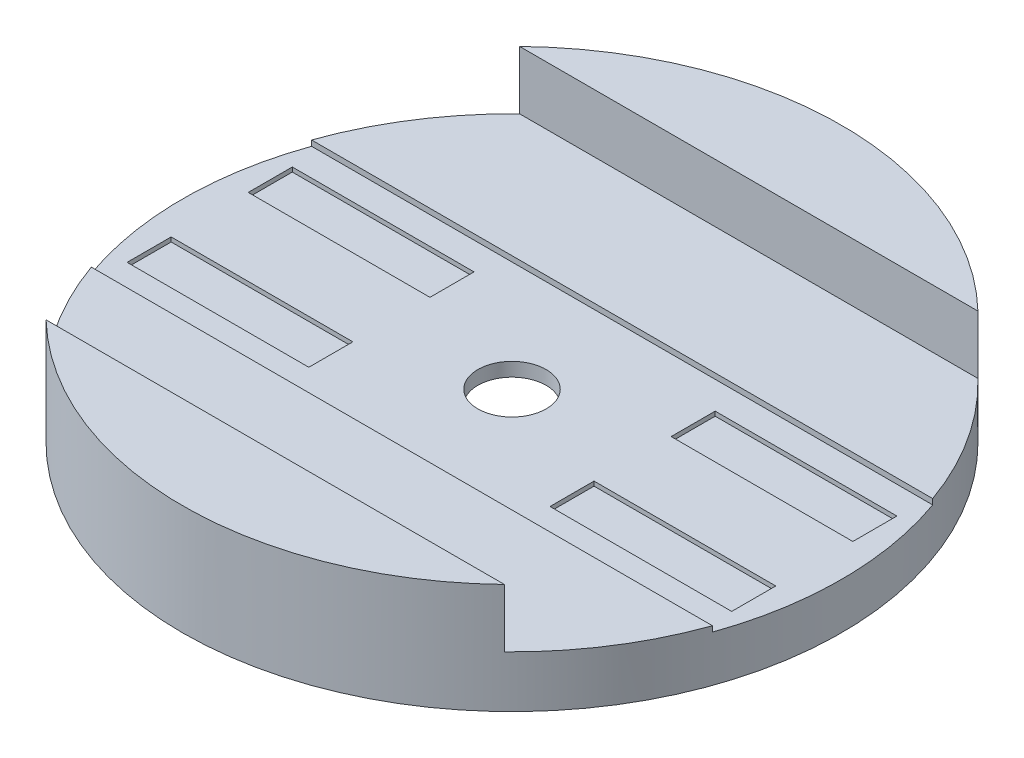
ISO-10303-21;
HEADER;
FILE_DESCRIPTION(('STEP AP214'),'2;1');
FILE_NAME('part.step','',(''),(''),'','','');
FILE_SCHEMA(('AUTOMOTIVE_DESIGN { 1 0 10303 214 1 1 1 1 }'));
ENDSEC;
DATA;
#1=APPLICATION_CONTEXT('core data for automotive mechanical design processes');
#2=APPLICATION_PROTOCOL_DEFINITION('international standard','automotive_design',2000,#1);
#3=PRODUCT_CONTEXT('',#1,'mechanical');
#4=PRODUCT('Part','Part','',(#3));
#5=PRODUCT_RELATED_PRODUCT_CATEGORY('part','',(#4));
#6=PRODUCT_DEFINITION_FORMATION('','',#4);
#7=PRODUCT_DEFINITION_CONTEXT('part definition',#1,'design');
#8=PRODUCT_DEFINITION('design','',#6,#7);
#9=PRODUCT_DEFINITION_SHAPE('','',#8);
#10=(LENGTH_UNIT() NAMED_UNIT(*) SI_UNIT(.MILLI.,.METRE.));
#11=(NAMED_UNIT(*) PLANE_ANGLE_UNIT() SI_UNIT($,.RADIAN.));
#12=(NAMED_UNIT(*) SI_UNIT($,.STERADIAN.) SOLID_ANGLE_UNIT());
#13=UNCERTAINTY_MEASURE_WITH_UNIT(LENGTH_MEASURE(1.E-05),#10,'distance_accuracy_value','');
#14=(GEOMETRIC_REPRESENTATION_CONTEXT(3) GLOBAL_UNCERTAINTY_ASSIGNED_CONTEXT((#13)) GLOBAL_UNIT_ASSIGNED_CONTEXT((#10,
#11,#12)) REPRESENTATION_CONTEXT('',''));
#15=CARTESIAN_POINT('',(0.,0.,0.));
#16=DIRECTION('',(0.,0.,1.));
#17=DIRECTION('',(1.,0.,0.));
#18=AXIS2_PLACEMENT_3D('',#15,#16,#17);
#19=CARTESIAN_POINT('',(0.,-8.062,0.));
#20=DIRECTION('',(0.,1.,0.));
#21=DIRECTION('',(0.,0.,1.));
#22=AXIS2_PLACEMENT_3D('',#19,#20,#21);
#23=CYLINDRICAL_SURFACE('',#22,7.874);
#24=CARTESIAN_POINT('',(0.,7.5,0.));
#25=DIRECTION('',(0.,-1.,0.));
#26=DIRECTION('',(0.,0.,-1.));
#27=AXIS2_PLACEMENT_3D('',#24,#25,#26);
#28=CIRCLE('',#27,7.874);
#29=CARTESIAN_POINT('',(0.,7.5,-7.874));
#30=VERTEX_POINT('',#29);
#31=EDGE_CURVE('E376',#30,#30,#28,.F.);
#32=ORIENTED_EDGE('',*,*,#31,.F.);
#33=EDGE_LOOP('',(#32));
#34=FACE_BOUND('',#33,.T.);
#35=CARTESIAN_POINT('',(0.,10.668,0.));
#36=DIRECTION('',(0.,1.,0.));
#37=DIRECTION('',(0.,0.,1.));
#38=AXIS2_PLACEMENT_3D('',#35,#36,#37);
#39=CIRCLE('',#38,7.874);
#40=CARTESIAN_POINT('',(0.,10.668,7.874));
#41=VERTEX_POINT('',#40);
#42=EDGE_CURVE('E369',#41,#41,#39,.F.);
#43=ORIENTED_EDGE('',*,*,#42,.F.);
#44=EDGE_LOOP('',(#43));
#45=FACE_BOUND('',#44,.T.);
#46=ADVANCED_FACE('F60',(#34,#45),#23,.F.);
#47=CARTESIAN_POINT('',(-58.0079555223723,11.938,0.));
#48=DIRECTION('',(0.,1.,0.));
#49=DIRECTION('',(0.,0.,1.));
#50=AXIS2_PLACEMENT_3D('',#47,#48,#49);
#51=PLANE('',#50);
#52=DIRECTION('',(1.,0.,0.));
#53=VECTOR('',#52,1.);
#54=CARTESIAN_POINT('',(-58.0079555223722,11.938,25.4));
#55=LINE('',#54,#53);
#56=CARTESIAN_POINT('',(-71.6298820325707,11.938,25.4));
#57=VERTEX_POINT('',#56);
#58=CARTESIAN_POINT('',(71.6298820325707,11.938,25.4));
#59=VERTEX_POINT('',#58);
#60=EDGE_CURVE('E417',#57,#59,#55,.T.);
#61=ORIENTED_EDGE('',*,*,#60,.F.);
#62=CARTESIAN_POINT('',(0.,11.938,0.));
#63=DIRECTION('',(0.,1.,0.));
#64=DIRECTION('',(0.,0.,1.));
#65=AXIS2_PLACEMENT_3D('',#62,#63,#64);
#66=CIRCLE('',#65,76.);
#67=CARTESIAN_POINT('',(-52.8559164143429,11.938,54.61));
#68=VERTEX_POINT('',#67);
#69=EDGE_CURVE('E408',#57,#68,#66,.T.);
#70=ORIENTED_EDGE('',*,*,#69,.T.);
#71=DIRECTION('',(1.,0.,0.));
#72=VECTOR('',#71,1.);
#73=CARTESIAN_POINT('',(-58.0079555223723,11.938,54.61));
#74=LINE('',#73,#72);
#75=CARTESIAN_POINT('',(52.8559164143429,11.938,54.61));
#76=VERTEX_POINT('',#75);
#77=EDGE_CURVE('E379',#68,#76,#74,.T.);
#78=ORIENTED_EDGE('',*,*,#77,.T.);
#79=EDGE_CURVE('E413',#76,#59,#66,.T.);
#80=ORIENTED_EDGE('',*,*,#79,.T.);
#81=EDGE_LOOP('',(#61,#70,#78,#80));
#82=FACE_BOUND('',#81,.T.);
#83=ADVANCED_FACE('F439',(#82),#51,.T.);
#84=CARTESIAN_POINT('',(0.,25.4,0.));
#85=DIRECTION('',(0.,1.,0.));
#86=DIRECTION('',(0.,0.,1.));
#87=AXIS2_PLACEMENT_3D('',#84,#85,#86);
#88=PLANE('',#87);
#89=DIRECTION('',(-1.,0.,0.));
#90=VECTOR('',#89,1.);
#91=CARTESIAN_POINT('',(0.,25.4,-54.61));
#92=LINE('',#91,#90);
#93=CARTESIAN_POINT('',(52.8559164143428,25.4,-54.61));
#94=VERTEX_POINT('',#93);
#95=CARTESIAN_POINT('',(-52.8559164143428,25.4,-54.61));
#96=VERTEX_POINT('',#95);
#97=EDGE_CURVE('E406',#94,#96,#92,.T.);
#98=ORIENTED_EDGE('',*,*,#97,.F.);
#99=CARTESIAN_POINT('',(0.,25.4,0.));
#100=DIRECTION('',(0.,1.,0.));
#101=DIRECTION('',(0.,0.,1.));
#102=AXIS2_PLACEMENT_3D('',#99,#100,#101);
#103=CIRCLE('',#102,76.);
#104=EDGE_CURVE('E401',#94,#96,#103,.T.);
#105=ORIENTED_EDGE('',*,*,#104,.T.);
#106=EDGE_LOOP('',(#98,#105));
#107=FACE_BOUND('',#106,.T.);
#108=ADVANCED_FACE('F450',(#107),#88,.T.);
#109=CARTESIAN_POINT('',(0.,25.4,0.));
#110=DIRECTION('',(0.,-1.,0.));
#111=DIRECTION('',(0.,0.,-1.));
#112=AXIS2_PLACEMENT_3D('',#109,#110,#111);
#113=CYLINDRICAL_SURFACE('',#112,76.);
#114=CARTESIAN_POINT('',(0.,10.668,0.));
#115=DIRECTION('',(0.,1.,0.));
#116=DIRECTION('',(0.,0.,1.));
#117=AXIS2_PLACEMENT_3D('',#114,#115,#116);
#118=CIRCLE('',#117,76.);
#119=CARTESIAN_POINT('',(71.6298820325707,10.668,25.4));
#120=VERTEX_POINT('',#119);
#121=CARTESIAN_POINT('',(71.6298820325707,10.668,-25.4000000000001));
#122=VERTEX_POINT('',#121);
#123=EDGE_CURVE('E12',#120,#122,#118,.T.);
#124=ORIENTED_EDGE('',*,*,#123,.F.);
#125=DIRECTION('',(0.,-1.,0.));
#126=VECTOR('',#125,1.);
#127=CARTESIAN_POINT('',(71.6298820325707,25.4,25.4));
#128=LINE('',#127,#126);
#129=EDGE_CURVE('E363',#120,#59,#128,.F.);
#130=ORIENTED_EDGE('',*,*,#129,.T.);
#131=ORIENTED_EDGE('',*,*,#79,.F.);
#132=DIRECTION('',(0.,-1.,0.));
#133=VECTOR('',#132,1.);
#134=CARTESIAN_POINT('',(52.8559164143429,25.4,54.61));
#135=LINE('',#134,#133);
#136=CARTESIAN_POINT('',(52.8559164143428,25.4,54.61));
#137=VERTEX_POINT('',#136);
#138=EDGE_CURVE('E385',#76,#137,#135,.F.);
#139=ORIENTED_EDGE('',*,*,#138,.T.);
#140=CARTESIAN_POINT('',(-52.8559164143429,25.4,54.61));
#141=VERTEX_POINT('',#140);
#142=EDGE_CURVE('E398',#141,#137,#103,.T.);
#143=ORIENTED_EDGE('',*,*,#142,.F.);
#144=DIRECTION('',(0.,-1.,0.));
#145=VECTOR('',#144,1.);
#146=CARTESIAN_POINT('',(-52.8559164143429,25.4,54.61));
#147=LINE('',#146,#145);
#148=EDGE_CURVE('E388',#141,#68,#147,.T.);
#149=ORIENTED_EDGE('',*,*,#148,.T.);
#150=ORIENTED_EDGE('',*,*,#69,.F.);
#151=DIRECTION('',(0.,-1.,0.));
#152=VECTOR('',#151,1.);
#153=CARTESIAN_POINT('',(-71.6298820325707,25.4,25.4));
#154=LINE('',#153,#152);
#155=CARTESIAN_POINT('',(-71.6298820325707,10.668,25.4));
#156=VERTEX_POINT('',#155);
#157=EDGE_CURVE('E366',#57,#156,#154,.T.);
#158=ORIENTED_EDGE('',*,*,#157,.T.);
#159=CARTESIAN_POINT('',(-71.6298820325707,10.668,-25.4));
#160=VERTEX_POINT('',#159);
#161=EDGE_CURVE('E64',#160,#156,#118,.T.);
#162=ORIENTED_EDGE('',*,*,#161,.F.);
#163=DIRECTION('',(0.,-1.,0.));
#164=VECTOR('',#163,1.);
#165=CARTESIAN_POINT('',(-71.6298820325707,25.4,-25.4));
#166=LINE('',#165,#164);
#167=CARTESIAN_POINT('',(-71.6298820325708,11.938,-25.4));
#168=VERTEX_POINT('',#167);
#169=EDGE_CURVE('E357',#160,#168,#166,.F.);
#170=ORIENTED_EDGE('',*,*,#169,.T.);
#171=CARTESIAN_POINT('',(-52.8559164143428,11.938,-54.61));
#172=VERTEX_POINT('',#171);
#173=EDGE_CURVE('E409',#172,#168,#66,.T.);
#174=ORIENTED_EDGE('',*,*,#173,.F.);
#175=DIRECTION('',(0.,-1.,0.));
#176=VECTOR('',#175,1.);
#177=CARTESIAN_POINT('',(-52.8559164143428,25.4,-54.61));
#178=LINE('',#177,#176);
#179=EDGE_CURVE('E391',#172,#96,#178,.F.);
#180=ORIENTED_EDGE('',*,*,#179,.T.);
#181=ORIENTED_EDGE('',*,*,#104,.F.);
#182=DIRECTION('',(0.,-1.,0.));
#183=VECTOR('',#182,1.);
#184=CARTESIAN_POINT('',(52.8559164143428,25.4,-54.61));
#185=LINE('',#184,#183);
#186=CARTESIAN_POINT('',(52.8559164143428,11.938,-54.61));
#187=VERTEX_POINT('',#186);
#188=EDGE_CURVE('E394',#94,#187,#185,.T.);
#189=ORIENTED_EDGE('',*,*,#188,.T.);
#190=CARTESIAN_POINT('',(71.6298820325707,11.938,-25.4000000000001));
#191=VERTEX_POINT('',#190);
#192=EDGE_CURVE('E412',#191,#187,#66,.T.);
#193=ORIENTED_EDGE('',*,*,#192,.F.);
#194=DIRECTION('',(0.,-1.,0.));
#195=VECTOR('',#194,1.);
#196=CARTESIAN_POINT('',(71.6298820325707,25.4,-25.4000000000001));
#197=LINE('',#196,#195);
#198=EDGE_CURVE('E360',#191,#122,#197,.T.);
#199=ORIENTED_EDGE('',*,*,#198,.T.);
#200=EDGE_LOOP('',(#124,#130,#131,#139,#143,#149,#150,#158,#162,#170,#174,#180,#181,#189,#193,#199));
#201=FACE_BOUND('',#200,.T.);
#202=CARTESIAN_POINT('',(0.,0.,0.));
#203=DIRECTION('',(0.,1.,0.));
#204=DIRECTION('',(0.,0.,1.));
#205=AXIS2_PLACEMENT_3D('',#202,#203,#204);
#206=CIRCLE('',#205,76.);
#207=CARTESIAN_POINT('',(0.,0.,76.));
#208=VERTEX_POINT('',#207);
#209=EDGE_CURVE('E397',#208,#208,#206,.T.);
#210=ORIENTED_EDGE('',*,*,#209,.T.);
#211=EDGE_LOOP('',(#210));
#212=FACE_BOUND('',#211,.T.);
#213=ADVANCED_FACE('F62',(#201,#212),#113,.T.);
#214=DIRECTION('',(1.,0.,0.));
#215=VECTOR('',#214,1.);
#216=CARTESIAN_POINT('',(0.,25.4,54.61));
#217=LINE('',#216,#215);
#218=EDGE_CURVE('E404',#141,#137,#217,.T.);
#219=ORIENTED_EDGE('',*,*,#218,.F.);
#220=ORIENTED_EDGE('',*,*,#142,.T.);
#221=EDGE_LOOP('',(#219,#220));
#222=FACE_BOUND('',#221,.T.);
#223=ADVANCED_FACE('F453',(#222),#88,.T.);
#224=CARTESIAN_POINT('',(0.,0.,0.));
#225=DIRECTION('',(0.,1.,0.));
#226=DIRECTION('',(0.,0.,1.));
#227=AXIS2_PLACEMENT_3D('',#224,#225,#226);
#228=PLANE('',#227);
#229=CARTESIAN_POINT('',(0.,0.,0.));
#230=DIRECTION('',(0.,-1.,0.));
#231=DIRECTION('',(0.,0.,-1.));
#232=AXIS2_PLACEMENT_3D('',#229,#230,#231);
#233=CIRCLE('',#232,70.);
#234=CARTESIAN_POINT('',(0.,0.,-70.));
#235=VERTEX_POINT('',#234);
#236=EDGE_CURVE('E372',#235,#235,#233,.T.);
#237=ORIENTED_EDGE('',*,*,#236,.F.);
#238=EDGE_LOOP('',(#237));
#239=FACE_BOUND('',#238,.T.);
#240=ORIENTED_EDGE('',*,*,#209,.F.);
#241=EDGE_LOOP('',(#240));
#242=FACE_BOUND('',#241,.T.);
#243=ADVANCED_FACE('F461',(#239,#242),#228,.F.);
#244=DIRECTION('',(-1.,0.,0.));
#245=VECTOR('',#244,1.);
#246=CARTESIAN_POINT('',(-58.0079555223723,11.938,-25.4));
#247=LINE('',#246,#245);
#248=EDGE_CURVE('E416',#191,#168,#247,.T.);
#249=ORIENTED_EDGE('',*,*,#248,.F.);
#250=ORIENTED_EDGE('',*,*,#192,.T.);
#251=DIRECTION('',(-1.,0.,0.));
#252=VECTOR('',#251,1.);
#253=CARTESIAN_POINT('',(-58.0079555223723,11.938,-54.61));
#254=LINE('',#253,#252);
#255=EDGE_CURVE('E382',#187,#172,#254,.T.);
#256=ORIENTED_EDGE('',*,*,#255,.T.);
#257=ORIENTED_EDGE('',*,*,#173,.T.);
#258=EDGE_LOOP('',(#249,#250,#256,#257));
#259=FACE_BOUND('',#258,.T.);
#260=ADVANCED_FACE('F443',(#259),#51,.T.);
#261=CARTESIAN_POINT('',(-58.0079555223723,11.938,-54.61));
#262=DIRECTION('',(0.,0.,-1.));
#263=DIRECTION('',(-1.,0.,0.));
#264=AXIS2_PLACEMENT_3D('',#261,#262,#263);
#265=PLANE('',#264);
#266=ORIENTED_EDGE('',*,*,#97,.T.);
#267=ORIENTED_EDGE('',*,*,#179,.F.);
#268=ORIENTED_EDGE('',*,*,#255,.F.);
#269=ORIENTED_EDGE('',*,*,#188,.F.);
#270=EDGE_LOOP('',(#266,#267,#268,#269));
#271=FACE_BOUND('',#270,.T.);
#272=ADVANCED_FACE('F445',(#271),#265,.F.);
#273=CARTESIAN_POINT('',(-58.0079555223723,11.938,54.61));
#274=DIRECTION('',(0.,0.,1.));
#275=DIRECTION('',(1.,0.,0.));
#276=AXIS2_PLACEMENT_3D('',#273,#274,#275);
#277=PLANE('',#276);
#278=ORIENTED_EDGE('',*,*,#218,.T.);
#279=ORIENTED_EDGE('',*,*,#138,.F.);
#280=ORIENTED_EDGE('',*,*,#77,.F.);
#281=ORIENTED_EDGE('',*,*,#148,.F.);
#282=EDGE_LOOP('',(#278,#279,#280,#281));
#283=FACE_BOUND('',#282,.T.);
#284=ADVANCED_FACE('F477',(#283),#277,.F.);
#285=CARTESIAN_POINT('',(0.,7.5,0.));
#286=DIRECTION('',(0.,-1.,0.));
#287=DIRECTION('',(0.,0.,-1.));
#288=AXIS2_PLACEMENT_3D('',#285,#286,#287);
#289=PLANE('',#288);
#290=CARTESIAN_POINT('',(0.,7.5,0.));
#291=DIRECTION('',(0.,-1.,0.));
#292=DIRECTION('',(0.,0.,-1.));
#293=AXIS2_PLACEMENT_3D('',#290,#291,#292);
#294=CIRCLE('',#293,70.);
#295=CARTESIAN_POINT('',(0.,7.5,-70.));
#296=VERTEX_POINT('',#295);
#297=EDGE_CURVE('E373',#296,#296,#294,.T.);
#298=ORIENTED_EDGE('',*,*,#297,.T.);
#299=EDGE_LOOP('',(#298));
#300=FACE_BOUND('',#299,.T.);
#301=ORIENTED_EDGE('',*,*,#31,.T.);
#302=EDGE_LOOP('',(#301));
#303=FACE_BOUND('',#302,.T.);
#304=ADVANCED_FACE('F479',(#300,#303),#289,.T.);
#305=CARTESIAN_POINT('',(0.,7.5,0.));
#306=DIRECTION('',(0.,-1.,0.));
#307=DIRECTION('',(0.,0.,-1.));
#308=AXIS2_PLACEMENT_3D('',#305,#306,#307);
#309=CYLINDRICAL_SURFACE('',#308,70.);
#310=ORIENTED_EDGE('',*,*,#297,.F.);
#311=EDGE_LOOP('',(#310));
#312=FACE_BOUND('',#311,.T.);
#313=ORIENTED_EDGE('',*,*,#236,.T.);
#314=EDGE_LOOP('',(#313));
#315=FACE_BOUND('',#314,.T.);
#316=ADVANCED_FACE('F472',(#312,#315),#309,.F.);
#317=CARTESIAN_POINT('',(76.,10.668,0.));
#318=DIRECTION('',(0.,1.,0.));
#319=DIRECTION('',(0.,0.,1.));
#320=AXIS2_PLACEMENT_3D('',#317,#318,#319);
#321=PLANE('',#320);
#322=DIRECTION('',(0.,0.,-1.));
#323=VECTOR('',#322,1.);
#324=CARTESIAN_POINT('',(69.723,10.668,-19.05));
#325=LINE('',#324,#323);
#326=CARTESIAN_POINT('',(69.723,10.668,-8.89000000000003));
#327=VERTEX_POINT('',#326);
#328=CARTESIAN_POINT('',(69.723,10.668,-19.05));
#329=VERTEX_POINT('',#328);
#330=EDGE_CURVE('E75',#327,#329,#325,.T.);
#331=ORIENTED_EDGE('',*,*,#330,.F.);
#332=DIRECTION('',(1.,0.,0.));
#333=VECTOR('',#332,1.);
#334=CARTESIAN_POINT('',(69.723,10.668,-8.89000000000003));
#335=LINE('',#334,#333);
#336=CARTESIAN_POINT('',(27.813,10.668,-8.89000000000002));
#337=VERTEX_POINT('',#336);
#338=EDGE_CURVE('E301',#337,#327,#335,.T.);
#339=ORIENTED_EDGE('',*,*,#338,.F.);
#340=DIRECTION('',(0.,0.,1.));
#341=VECTOR('',#340,1.);
#342=CARTESIAN_POINT('',(27.813,10.668,-19.05));
#343=LINE('',#342,#341);
#344=CARTESIAN_POINT('',(27.813,10.668,-19.05));
#345=VERTEX_POINT('',#344);
#346=EDGE_CURVE('E304',#345,#337,#343,.T.);
#347=ORIENTED_EDGE('',*,*,#346,.F.);
#348=DIRECTION('',(-1.,0.,0.));
#349=VECTOR('',#348,1.);
#350=CARTESIAN_POINT('',(69.723,10.668,-19.05));
#351=LINE('',#350,#349);
#352=EDGE_CURVE('E308',#329,#345,#351,.T.);
#353=ORIENTED_EDGE('',*,*,#352,.F.);
#354=EDGE_LOOP('',(#331,#339,#347,#353));
#355=FACE_BOUND('',#354,.T.);
#356=DIRECTION('',(1.,0.,0.));
#357=VECTOR('',#356,1.);
#358=CARTESIAN_POINT('',(69.723,10.668,19.05));
#359=LINE('',#358,#357);
#360=CARTESIAN_POINT('',(27.813,10.668,19.05));
#361=VERTEX_POINT('',#360);
#362=CARTESIAN_POINT('',(69.723,10.668,19.05));
#363=VERTEX_POINT('',#362);
#364=EDGE_CURVE('E83',#361,#363,#359,.T.);
#365=ORIENTED_EDGE('',*,*,#364,.F.);
#366=DIRECTION('',(0.,0.,1.));
#367=VECTOR('',#366,1.);
#368=CARTESIAN_POINT('',(27.813,10.668,19.05));
#369=LINE('',#368,#367);
#370=CARTESIAN_POINT('',(27.813,10.668,8.89000000000001));
#371=VERTEX_POINT('',#370);
#372=EDGE_CURVE('E271',#371,#361,#369,.T.);
#373=ORIENTED_EDGE('',*,*,#372,.F.);
#374=DIRECTION('',(-1.,0.,0.));
#375=VECTOR('',#374,1.);
#376=CARTESIAN_POINT('',(69.723,10.668,8.89));
#377=LINE('',#376,#375);
#378=CARTESIAN_POINT('',(69.723,10.668,8.89));
#379=VERTEX_POINT('',#378);
#380=EDGE_CURVE('E274',#379,#371,#377,.T.);
#381=ORIENTED_EDGE('',*,*,#380,.F.);
#382=DIRECTION('',(0.,0.,-1.));
#383=VECTOR('',#382,1.);
#384=CARTESIAN_POINT('',(69.723,10.668,19.05));
#385=LINE('',#384,#383);
#386=EDGE_CURVE('E278',#363,#379,#385,.T.);
#387=ORIENTED_EDGE('',*,*,#386,.F.);
#388=EDGE_LOOP('',(#365,#373,#381,#387));
#389=FACE_BOUND('',#388,.T.);
#390=DIRECTION('',(0.,0.,1.));
#391=VECTOR('',#390,1.);
#392=CARTESIAN_POINT('',(-69.723,10.668,19.05));
#393=LINE('',#392,#391);
#394=CARTESIAN_POINT('',(-69.723,10.668,8.89000000000001));
#395=VERTEX_POINT('',#394);
#396=CARTESIAN_POINT('',(-69.723,10.668,19.05));
#397=VERTEX_POINT('',#396);
#398=EDGE_CURVE('E223',#395,#397,#393,.T.);
#399=ORIENTED_EDGE('',*,*,#398,.F.);
#400=DIRECTION('',(-1.,0.,0.));
#401=VECTOR('',#400,1.);
#402=CARTESIAN_POINT('',(-69.723,10.668,8.89000000000001));
#403=LINE('',#402,#401);
#404=CARTESIAN_POINT('',(-27.813,10.668,8.89000000000001));
#405=VERTEX_POINT('',#404);
#406=EDGE_CURVE('E233',#405,#395,#403,.T.);
#407=ORIENTED_EDGE('',*,*,#406,.F.);
#408=DIRECTION('',(0.,0.,-1.));
#409=VECTOR('',#408,1.);
#410=CARTESIAN_POINT('',(-27.813,10.668,19.05));
#411=LINE('',#410,#409);
#412=CARTESIAN_POINT('',(-27.813,10.668,19.05));
#413=VERTEX_POINT('',#412);
#414=EDGE_CURVE('E238',#413,#405,#411,.T.);
#415=ORIENTED_EDGE('',*,*,#414,.F.);
#416=DIRECTION('',(1.,0.,0.));
#417=VECTOR('',#416,1.);
#418=CARTESIAN_POINT('',(-69.723,10.668,19.05));
#419=LINE('',#418,#417);
#420=EDGE_CURVE('E244',#397,#413,#419,.T.);
#421=ORIENTED_EDGE('',*,*,#420,.F.);
#422=EDGE_LOOP('',(#399,#407,#415,#421));
#423=FACE_BOUND('',#422,.T.);
#424=DIRECTION('',(0.,0.,1.));
#425=VECTOR('',#424,1.);
#426=CARTESIAN_POINT('',(-69.723,10.668,-19.05));
#427=LINE('',#426,#425);
#428=CARTESIAN_POINT('',(-69.723,10.668,-19.05));
#429=VERTEX_POINT('',#428);
#430=CARTESIAN_POINT('',(-69.723,10.668,-8.89000000000001));
#431=VERTEX_POINT('',#430);
#432=EDGE_CURVE('E245',#429,#431,#427,.T.);
#433=ORIENTED_EDGE('',*,*,#432,.F.);
#434=DIRECTION('',(-1.,0.,0.));
#435=VECTOR('',#434,1.);
#436=CARTESIAN_POINT('',(-69.723,10.668,-19.05));
#437=LINE('',#436,#435);
#438=CARTESIAN_POINT('',(-27.813,10.668,-19.05));
#439=VERTEX_POINT('',#438);
#440=EDGE_CURVE('E326',#439,#429,#437,.T.);
#441=ORIENTED_EDGE('',*,*,#440,.F.);
#442=DIRECTION('',(0.,0.,-1.));
#443=VECTOR('',#442,1.);
#444=CARTESIAN_POINT('',(-27.813,10.668,-19.05));
#445=LINE('',#444,#443);
#446=CARTESIAN_POINT('',(-27.813,10.668,-8.89000000000001));
#447=VERTEX_POINT('',#446);
#448=EDGE_CURVE('E338',#447,#439,#445,.T.);
#449=ORIENTED_EDGE('',*,*,#448,.F.);
#450=DIRECTION('',(1.,0.,0.));
#451=VECTOR('',#450,1.);
#452=CARTESIAN_POINT('',(-69.723,10.668,-8.89000000000001));
#453=LINE('',#452,#451);
#454=EDGE_CURVE('E247',#431,#447,#453,.T.);
#455=ORIENTED_EDGE('',*,*,#454,.F.);
#456=EDGE_LOOP('',(#433,#441,#449,#455));
#457=FACE_BOUND('',#456,.T.);
#458=ORIENTED_EDGE('',*,*,#123,.T.);
#459=DIRECTION('',(-1.,0.,0.));
#460=VECTOR('',#459,1.);
#461=CARTESIAN_POINT('',(76.,10.668,-25.4000000000001));
#462=LINE('',#461,#460);
#463=EDGE_CURVE('E345',#122,#160,#462,.T.);
#464=ORIENTED_EDGE('',*,*,#463,.T.);
#465=ORIENTED_EDGE('',*,*,#161,.T.);
#466=DIRECTION('',(1.,0.,0.));
#467=VECTOR('',#466,1.);
#468=CARTESIAN_POINT('',(76.,10.668,25.4));
#469=LINE('',#468,#467);
#470=EDGE_CURVE('E354',#156,#120,#469,.T.);
#471=ORIENTED_EDGE('',*,*,#470,.T.);
#472=EDGE_LOOP('',(#458,#464,#465,#471));
#473=FACE_BOUND('',#472,.T.);
#474=ORIENTED_EDGE('',*,*,#42,.T.);
#475=EDGE_LOOP('',(#474));
#476=FACE_BOUND('',#475,.T.);
#477=ADVANCED_FACE('F241',(#355,#389,#423,#457,#473,#476),#321,.T.);
#478=CARTESIAN_POINT('',(76.,10.668,25.4));
#479=DIRECTION('',(0.,0.,1.));
#480=DIRECTION('',(1.,0.,0.));
#481=AXIS2_PLACEMENT_3D('',#478,#479,#480);
#482=PLANE('',#481);
#483=ORIENTED_EDGE('',*,*,#60,.T.);
#484=ORIENTED_EDGE('',*,*,#129,.F.);
#485=ORIENTED_EDGE('',*,*,#470,.F.);
#486=ORIENTED_EDGE('',*,*,#157,.F.);
#487=EDGE_LOOP('',(#483,#484,#485,#486));
#488=FACE_BOUND('',#487,.T.);
#489=ADVANCED_FACE('F427',(#488),#482,.F.);
#490=CARTESIAN_POINT('',(76.,10.668,-25.4000000000001));
#491=DIRECTION('',(0.,0.,-1.));
#492=DIRECTION('',(-1.,0.,0.));
#493=AXIS2_PLACEMENT_3D('',#490,#491,#492);
#494=PLANE('',#493);
#495=ORIENTED_EDGE('',*,*,#248,.T.);
#496=ORIENTED_EDGE('',*,*,#169,.F.);
#497=ORIENTED_EDGE('',*,*,#463,.F.);
#498=ORIENTED_EDGE('',*,*,#198,.F.);
#499=EDGE_LOOP('',(#495,#496,#497,#498));
#500=FACE_BOUND('',#499,.T.);
#501=ADVANCED_FACE('F441',(#500),#494,.F.);
#502=CARTESIAN_POINT('',(-69.723,9.652,-19.05));
#503=DIRECTION('',(-1.,0.,0.));
#504=DIRECTION('',(0.,0.,1.));
#505=AXIS2_PLACEMENT_3D('',#502,#503,#504);
#506=PLANE('',#505);
#507=ORIENTED_EDGE('',*,*,#432,.T.);
#508=DIRECTION('',(0.,1.,0.));
#509=VECTOR('',#508,1.);
#510=CARTESIAN_POINT('',(-69.723,9.652,-8.89000000000001));
#511=LINE('',#510,#509);
#512=CARTESIAN_POINT('',(-69.723,9.652,-8.89000000000001));
#513=VERTEX_POINT('',#512);
#514=EDGE_CURVE('E334',#513,#431,#511,.T.);
#515=ORIENTED_EDGE('',*,*,#514,.F.);
#516=DIRECTION('',(0.,0.,1.));
#517=VECTOR('',#516,1.);
#518=CARTESIAN_POINT('',(-69.723,9.652,-19.05));
#519=LINE('',#518,#517);
#520=CARTESIAN_POINT('',(-69.723,9.652,-19.05));
#521=VERTEX_POINT('',#520);
#522=EDGE_CURVE('E322',#521,#513,#519,.T.);
#523=ORIENTED_EDGE('',*,*,#522,.F.);
#524=DIRECTION('',(0.,1.,0.));
#525=VECTOR('',#524,1.);
#526=CARTESIAN_POINT('',(-69.723,9.652,-19.05));
#527=LINE('',#526,#525);
#528=EDGE_CURVE('E343',#521,#429,#527,.T.);
#529=ORIENTED_EDGE('',*,*,#528,.T.);
#530=EDGE_LOOP('',(#507,#515,#523,#529));
#531=FACE_BOUND('',#530,.T.);
#532=ADVANCED_FACE('F494',(#531),#506,.F.);
#533=CARTESIAN_POINT('',(-69.723,9.652,-19.05));
#534=DIRECTION('',(0.,0.,-1.));
#535=DIRECTION('',(-1.,0.,0.));
#536=AXIS2_PLACEMENT_3D('',#533,#534,#535);
#537=PLANE('',#536);
#538=ORIENTED_EDGE('',*,*,#440,.T.);
#539=ORIENTED_EDGE('',*,*,#528,.F.);
#540=DIRECTION('',(-1.,0.,0.));
#541=VECTOR('',#540,1.);
#542=CARTESIAN_POINT('',(-69.723,9.652,-19.05));
#543=LINE('',#542,#541);
#544=CARTESIAN_POINT('',(-27.813,9.652,-19.05));
#545=VERTEX_POINT('',#544);
#546=EDGE_CURVE('E332',#545,#521,#543,.T.);
#547=ORIENTED_EDGE('',*,*,#546,.F.);
#548=DIRECTION('',(0.,1.,0.));
#549=VECTOR('',#548,1.);
#550=CARTESIAN_POINT('',(-27.813,9.652,-19.05));
#551=LINE('',#550,#549);
#552=EDGE_CURVE('E346',#545,#439,#551,.T.);
#553=ORIENTED_EDGE('',*,*,#552,.T.);
#554=EDGE_LOOP('',(#538,#539,#547,#553));
#555=FACE_BOUND('',#554,.T.);
#556=ADVANCED_FACE('F502',(#555),#537,.F.);
#557=CARTESIAN_POINT('',(-27.813,9.652,-19.05));
#558=DIRECTION('',(1.,0.,0.));
#559=DIRECTION('',(0.,0.,-1.));
#560=AXIS2_PLACEMENT_3D('',#557,#558,#559);
#561=PLANE('',#560);
#562=ORIENTED_EDGE('',*,*,#448,.T.);
#563=ORIENTED_EDGE('',*,*,#552,.F.);
#564=DIRECTION('',(0.,0.,-1.));
#565=VECTOR('',#564,1.);
#566=CARTESIAN_POINT('',(-27.813,9.652,-19.05));
#567=LINE('',#566,#565);
#568=CARTESIAN_POINT('',(-27.813,9.652,-8.89000000000001));
#569=VERTEX_POINT('',#568);
#570=EDGE_CURVE('E329',#569,#545,#567,.T.);
#571=ORIENTED_EDGE('',*,*,#570,.F.);
#572=DIRECTION('',(0.,1.,0.));
#573=VECTOR('',#572,1.);
#574=CARTESIAN_POINT('',(-27.813,9.652,-8.89000000000001));
#575=LINE('',#574,#573);
#576=EDGE_CURVE('E348',#569,#447,#575,.T.);
#577=ORIENTED_EDGE('',*,*,#576,.T.);
#578=EDGE_LOOP('',(#562,#563,#571,#577));
#579=FACE_BOUND('',#578,.T.);
#580=ADVANCED_FACE('F508',(#579),#561,.F.);
#581=CARTESIAN_POINT('',(-69.723,9.652,-8.89000000000001));
#582=DIRECTION('',(0.,0.,1.));
#583=DIRECTION('',(1.,0.,0.));
#584=AXIS2_PLACEMENT_3D('',#581,#582,#583);
#585=PLANE('',#584);
#586=ORIENTED_EDGE('',*,*,#454,.T.);
#587=ORIENTED_EDGE('',*,*,#576,.F.);
#588=DIRECTION('',(1.,0.,0.));
#589=VECTOR('',#588,1.);
#590=CARTESIAN_POINT('',(-69.723,9.652,-8.89000000000001));
#591=LINE('',#590,#589);
#592=EDGE_CURVE('E325',#513,#569,#591,.T.);
#593=ORIENTED_EDGE('',*,*,#592,.F.);
#594=ORIENTED_EDGE('',*,*,#514,.T.);
#595=EDGE_LOOP('',(#586,#587,#593,#594));
#596=FACE_BOUND('',#595,.T.);
#597=ADVANCED_FACE('F504',(#596),#585,.F.);
#598=CARTESIAN_POINT('',(0.,9.652,0.));
#599=DIRECTION('',(0.,1.,0.));
#600=DIRECTION('',(0.,0.,1.));
#601=AXIS2_PLACEMENT_3D('',#598,#599,#600);
#602=PLANE('',#601);
#603=ORIENTED_EDGE('',*,*,#522,.T.);
#604=ORIENTED_EDGE('',*,*,#592,.T.);
#605=ORIENTED_EDGE('',*,*,#570,.T.);
#606=ORIENTED_EDGE('',*,*,#546,.T.);
#607=EDGE_LOOP('',(#603,#604,#605,#606));
#608=FACE_BOUND('',#607,.T.);
#609=ADVANCED_FACE('F507',(#608),#602,.T.);
#610=CARTESIAN_POINT('',(-69.723,9.652,19.05));
#611=DIRECTION('',(-1.,0.,0.));
#612=DIRECTION('',(0.,0.,1.));
#613=AXIS2_PLACEMENT_3D('',#610,#611,#612);
#614=PLANE('',#613);
#615=ORIENTED_EDGE('',*,*,#398,.T.);
#616=DIRECTION('',(0.,1.,0.));
#617=VECTOR('',#616,1.);
#618=CARTESIAN_POINT('',(-69.723,9.652,19.05));
#619=LINE('',#618,#617);
#620=CARTESIAN_POINT('',(-69.723,9.652,19.05));
#621=VERTEX_POINT('',#620);
#622=EDGE_CURVE('E255',#621,#397,#619,.T.);
#623=ORIENTED_EDGE('',*,*,#622,.F.);
#624=DIRECTION('',(0.,0.,1.));
#625=VECTOR('',#624,1.);
#626=CARTESIAN_POINT('',(-69.723,9.652,19.05));
#627=LINE('',#626,#625);
#628=CARTESIAN_POINT('',(-69.723,9.652,8.89000000000001));
#629=VERTEX_POINT('',#628);
#630=EDGE_CURVE('E226',#629,#621,#627,.T.);
#631=ORIENTED_EDGE('',*,*,#630,.F.);
#632=DIRECTION('',(0.,1.,0.));
#633=VECTOR('',#632,1.);
#634=CARTESIAN_POINT('',(-69.723,9.652,8.89000000000001));
#635=LINE('',#634,#633);
#636=EDGE_CURVE('E219',#629,#395,#635,.T.);
#637=ORIENTED_EDGE('',*,*,#636,.T.);
#638=EDGE_LOOP('',(#615,#623,#631,#637));
#639=FACE_BOUND('',#638,.T.);
#640=ADVANCED_FACE('F221',(#639),#614,.F.);
#641=CARTESIAN_POINT('',(-69.723,9.652,8.89000000000001));
#642=DIRECTION('',(0.,0.,-1.));
#643=DIRECTION('',(-1.,0.,0.));
#644=AXIS2_PLACEMENT_3D('',#641,#642,#643);
#645=PLANE('',#644);
#646=ORIENTED_EDGE('',*,*,#406,.T.);
#647=ORIENTED_EDGE('',*,*,#636,.F.);
#648=DIRECTION('',(-1.,0.,0.));
#649=VECTOR('',#648,1.);
#650=CARTESIAN_POINT('',(-69.723,9.652,8.89000000000001));
#651=LINE('',#650,#649);
#652=CARTESIAN_POINT('',(-27.813,9.652,8.89000000000001));
#653=VERTEX_POINT('',#652);
#654=EDGE_CURVE('E252',#653,#629,#651,.T.);
#655=ORIENTED_EDGE('',*,*,#654,.F.);
#656=DIRECTION('',(0.,1.,0.));
#657=VECTOR('',#656,1.);
#658=CARTESIAN_POINT('',(-27.813,9.652,8.89000000000001));
#659=LINE('',#658,#657);
#660=EDGE_CURVE('E230',#653,#405,#659,.T.);
#661=ORIENTED_EDGE('',*,*,#660,.T.);
#662=EDGE_LOOP('',(#646,#647,#655,#661));
#663=FACE_BOUND('',#662,.T.);
#664=ADVANCED_FACE('F234',(#663),#645,.F.);
#665=CARTESIAN_POINT('',(-27.813,9.652,19.05));
#666=DIRECTION('',(1.,0.,0.));
#667=DIRECTION('',(0.,0.,-1.));
#668=AXIS2_PLACEMENT_3D('',#665,#666,#667);
#669=PLANE('',#668);
#670=ORIENTED_EDGE('',*,*,#414,.T.);
#671=ORIENTED_EDGE('',*,*,#660,.F.);
#672=DIRECTION('',(0.,0.,-1.));
#673=VECTOR('',#672,1.);
#674=CARTESIAN_POINT('',(-27.813,9.652,19.05));
#675=LINE('',#674,#673);
#676=CARTESIAN_POINT('',(-27.813,9.652,19.05));
#677=VERTEX_POINT('',#676);
#678=EDGE_CURVE('E254',#677,#653,#675,.T.);
#679=ORIENTED_EDGE('',*,*,#678,.F.);
#680=DIRECTION('',(0.,1.,0.));
#681=VECTOR('',#680,1.);
#682=CARTESIAN_POINT('',(-27.813,9.652,19.05));
#683=LINE('',#682,#681);
#684=EDGE_CURVE('E774',#677,#413,#683,.T.);
#685=ORIENTED_EDGE('',*,*,#684,.T.);
#686=EDGE_LOOP('',(#670,#671,#679,#685));
#687=FACE_BOUND('',#686,.T.);
#688=ADVANCED_FACE('F564',(#687),#669,.F.);
#689=CARTESIAN_POINT('',(-69.723,9.652,19.05));
#690=DIRECTION('',(0.,0.,1.));
#691=DIRECTION('',(1.,0.,0.));
#692=AXIS2_PLACEMENT_3D('',#689,#690,#691);
#693=PLANE('',#692);
#694=ORIENTED_EDGE('',*,*,#420,.T.);
#695=ORIENTED_EDGE('',*,*,#684,.F.);
#696=DIRECTION('',(1.,0.,0.));
#697=VECTOR('',#696,1.);
#698=CARTESIAN_POINT('',(-69.723,9.652,19.05));
#699=LINE('',#698,#697);
#700=EDGE_CURVE('E258',#621,#677,#699,.T.);
#701=ORIENTED_EDGE('',*,*,#700,.F.);
#702=ORIENTED_EDGE('',*,*,#622,.T.);
#703=EDGE_LOOP('',(#694,#695,#701,#702));
#704=FACE_BOUND('',#703,.T.);
#705=ADVANCED_FACE('F560',(#704),#693,.F.);
#706=CARTESIAN_POINT('',(0.,9.652,0.));
#707=DIRECTION('',(0.,-1.,0.));
#708=DIRECTION('',(0.,0.,-1.));
#709=AXIS2_PLACEMENT_3D('',#706,#707,#708);
#710=PLANE('',#709);
#711=ORIENTED_EDGE('',*,*,#630,.T.);
#712=ORIENTED_EDGE('',*,*,#700,.T.);
#713=ORIENTED_EDGE('',*,*,#678,.T.);
#714=ORIENTED_EDGE('',*,*,#654,.T.);
#715=EDGE_LOOP('',(#711,#712,#713,#714));
#716=FACE_BOUND('',#715,.T.);
#717=ADVANCED_FACE('F557',(#716),#710,.F.);
#718=CARTESIAN_POINT('',(69.723,9.652,19.05));
#719=DIRECTION('',(0.,0.,1.));
#720=DIRECTION('',(1.,0.,0.));
#721=AXIS2_PLACEMENT_3D('',#718,#719,#720);
#722=PLANE('',#721);
#723=ORIENTED_EDGE('',*,*,#364,.T.);
#724=DIRECTION('',(0.,1.,0.));
#725=VECTOR('',#724,1.);
#726=CARTESIAN_POINT('',(69.723,9.652,19.05));
#727=LINE('',#726,#725);
#728=CARTESIAN_POINT('',(69.723,9.652,19.05));
#729=VERTEX_POINT('',#728);
#730=EDGE_CURVE('E262',#729,#363,#727,.T.);
#731=ORIENTED_EDGE('',*,*,#730,.F.);
#732=DIRECTION('',(1.,0.,0.));
#733=VECTOR('',#732,1.);
#734=CARTESIAN_POINT('',(69.723,9.652,19.05));
#735=LINE('',#734,#733);
#736=CARTESIAN_POINT('',(27.813,9.652,19.05));
#737=VERTEX_POINT('',#736);
#738=EDGE_CURVE('E275',#737,#729,#735,.T.);
#739=ORIENTED_EDGE('',*,*,#738,.F.);
#740=DIRECTION('',(0.,1.,0.));
#741=VECTOR('',#740,1.);
#742=CARTESIAN_POINT('',(27.813,9.652,19.05));
#743=LINE('',#742,#741);
#744=EDGE_CURVE('E269',#737,#361,#743,.T.);
#745=ORIENTED_EDGE('',*,*,#744,.T.);
#746=EDGE_LOOP('',(#723,#731,#739,#745));
#747=FACE_BOUND('',#746,.T.);
#748=ADVANCED_FACE('F547',(#747),#722,.F.);
#749=CARTESIAN_POINT('',(27.813,9.652,19.05));
#750=DIRECTION('',(-1.,0.,0.));
#751=DIRECTION('',(0.,0.,1.));
#752=AXIS2_PLACEMENT_3D('',#749,#750,#751);
#753=PLANE('',#752);
#754=ORIENTED_EDGE('',*,*,#372,.T.);
#755=ORIENTED_EDGE('',*,*,#744,.F.);
#756=DIRECTION('',(0.,0.,1.));
#757=VECTOR('',#756,1.);
#758=CARTESIAN_POINT('',(27.813,9.652,19.05));
#759=LINE('',#758,#757);
#760=CARTESIAN_POINT('',(27.813,9.652,8.89000000000001));
#761=VERTEX_POINT('',#760);
#762=EDGE_CURVE('E264',#761,#737,#759,.T.);
#763=ORIENTED_EDGE('',*,*,#762,.F.);
#764=DIRECTION('',(0.,1.,0.));
#765=VECTOR('',#764,1.);
#766=CARTESIAN_POINT('',(27.813,9.652,8.89000000000001));
#767=LINE('',#766,#765);
#768=EDGE_CURVE('E267',#761,#371,#767,.T.);
#769=ORIENTED_EDGE('',*,*,#768,.T.);
#770=EDGE_LOOP('',(#754,#755,#763,#769));
#771=FACE_BOUND('',#770,.T.);
#772=ADVANCED_FACE('F543',(#771),#753,.F.);
#773=CARTESIAN_POINT('',(69.723,9.652,8.89));
#774=DIRECTION('',(0.,0.,-1.));
#775=DIRECTION('',(-1.,0.,0.));
#776=AXIS2_PLACEMENT_3D('',#773,#774,#775);
#777=PLANE('',#776);
#778=ORIENTED_EDGE('',*,*,#380,.T.);
#779=ORIENTED_EDGE('',*,*,#768,.F.);
#780=DIRECTION('',(-1.,0.,0.));
#781=VECTOR('',#780,1.);
#782=CARTESIAN_POINT('',(69.723,9.652,8.89));
#783=LINE('',#782,#781);
#784=CARTESIAN_POINT('',(69.723,9.652,8.89));
#785=VERTEX_POINT('',#784);
#786=EDGE_CURVE('E284',#785,#761,#783,.T.);
#787=ORIENTED_EDGE('',*,*,#786,.F.);
#788=DIRECTION('',(0.,1.,0.));
#789=VECTOR('',#788,1.);
#790=CARTESIAN_POINT('',(69.723,9.652,8.89));
#791=LINE('',#790,#789);
#792=EDGE_CURVE('E265',#785,#379,#791,.T.);
#793=ORIENTED_EDGE('',*,*,#792,.T.);
#794=EDGE_LOOP('',(#778,#779,#787,#793));
#795=FACE_BOUND('',#794,.T.);
#796=ADVANCED_FACE('F546',(#795),#777,.F.);
#797=CARTESIAN_POINT('',(69.723,9.652,19.05));
#798=DIRECTION('',(1.,0.,0.));
#799=DIRECTION('',(0.,0.,-1.));
#800=AXIS2_PLACEMENT_3D('',#797,#798,#799);
#801=PLANE('',#800);
#802=ORIENTED_EDGE('',*,*,#386,.T.);
#803=ORIENTED_EDGE('',*,*,#792,.F.);
#804=DIRECTION('',(0.,0.,-1.));
#805=VECTOR('',#804,1.);
#806=CARTESIAN_POINT('',(69.723,9.652,19.05));
#807=LINE('',#806,#805);
#808=EDGE_CURVE('E287',#729,#785,#807,.T.);
#809=ORIENTED_EDGE('',*,*,#808,.F.);
#810=ORIENTED_EDGE('',*,*,#730,.T.);
#811=EDGE_LOOP('',(#802,#803,#809,#810));
#812=FACE_BOUND('',#811,.T.);
#813=ADVANCED_FACE('F541',(#812),#801,.F.);
#814=CARTESIAN_POINT('',(0.,9.652,0.));
#815=DIRECTION('',(0.,-1.,0.));
#816=DIRECTION('',(0.,0.,-1.));
#817=AXIS2_PLACEMENT_3D('',#814,#815,#816);
#818=PLANE('',#817);
#819=ORIENTED_EDGE('',*,*,#738,.T.);
#820=ORIENTED_EDGE('',*,*,#808,.T.);
#821=ORIENTED_EDGE('',*,*,#786,.T.);
#822=ORIENTED_EDGE('',*,*,#762,.T.);
#823=EDGE_LOOP('',(#819,#820,#821,#822));
#824=FACE_BOUND('',#823,.T.);
#825=ADVANCED_FACE('F538',(#824),#818,.F.);
#826=CARTESIAN_POINT('',(69.723,9.652,-19.05));
#827=DIRECTION('',(1.,0.,0.));
#828=DIRECTION('',(0.,0.,-1.));
#829=AXIS2_PLACEMENT_3D('',#826,#827,#828);
#830=PLANE('',#829);
#831=ORIENTED_EDGE('',*,*,#330,.T.);
#832=DIRECTION('',(0.,1.,0.));
#833=VECTOR('',#832,1.);
#834=CARTESIAN_POINT('',(69.723,9.652,-19.05));
#835=LINE('',#834,#833);
#836=CARTESIAN_POINT('',(69.723,9.652,-19.05));
#837=VERTEX_POINT('',#836);
#838=EDGE_CURVE('E292',#837,#329,#835,.T.);
#839=ORIENTED_EDGE('',*,*,#838,.F.);
#840=DIRECTION('',(0.,0.,-1.));
#841=VECTOR('',#840,1.);
#842=CARTESIAN_POINT('',(69.723,9.652,-19.05));
#843=LINE('',#842,#841);
#844=CARTESIAN_POINT('',(69.723,9.652,-8.89000000000003));
#845=VERTEX_POINT('',#844);
#846=EDGE_CURVE('E305',#845,#837,#843,.T.);
#847=ORIENTED_EDGE('',*,*,#846,.F.);
#848=DIRECTION('',(0.,1.,0.));
#849=VECTOR('',#848,1.);
#850=CARTESIAN_POINT('',(69.723,9.652,-8.89000000000003));
#851=LINE('',#850,#849);
#852=EDGE_CURVE('E299',#845,#327,#851,.T.);
#853=ORIENTED_EDGE('',*,*,#852,.T.);
#854=EDGE_LOOP('',(#831,#839,#847,#853));
#855=FACE_BOUND('',#854,.T.);
#856=ADVANCED_FACE('F528',(#855),#830,.F.);
#857=CARTESIAN_POINT('',(69.723,9.652,-8.89000000000003));
#858=DIRECTION('',(0.,0.,1.));
#859=DIRECTION('',(1.,0.,0.));
#860=AXIS2_PLACEMENT_3D('',#857,#858,#859);
#861=PLANE('',#860);
#862=ORIENTED_EDGE('',*,*,#338,.T.);
#863=ORIENTED_EDGE('',*,*,#852,.F.);
#864=DIRECTION('',(1.,0.,0.));
#865=VECTOR('',#864,1.);
#866=CARTESIAN_POINT('',(69.723,9.652,-8.89000000000003));
#867=LINE('',#866,#865);
#868=CARTESIAN_POINT('',(27.813,9.652,-8.89000000000002));
#869=VERTEX_POINT('',#868);
#870=EDGE_CURVE('E294',#869,#845,#867,.T.);
#871=ORIENTED_EDGE('',*,*,#870,.F.);
#872=DIRECTION('',(0.,1.,0.));
#873=VECTOR('',#872,1.);
#874=CARTESIAN_POINT('',(27.813,9.652,-8.89000000000002));
#875=LINE('',#874,#873);
#876=EDGE_CURVE('E297',#869,#337,#875,.T.);
#877=ORIENTED_EDGE('',*,*,#876,.T.);
#878=EDGE_LOOP('',(#862,#863,#871,#877));
#879=FACE_BOUND('',#878,.T.);
#880=ADVANCED_FACE('F524',(#879),#861,.F.);
#881=CARTESIAN_POINT('',(27.813,9.652,-19.05));
#882=DIRECTION('',(-1.,0.,0.));
#883=DIRECTION('',(0.,0.,1.));
#884=AXIS2_PLACEMENT_3D('',#881,#882,#883);
#885=PLANE('',#884);
#886=ORIENTED_EDGE('',*,*,#346,.T.);
#887=ORIENTED_EDGE('',*,*,#876,.F.);
#888=DIRECTION('',(0.,0.,1.));
#889=VECTOR('',#888,1.);
#890=CARTESIAN_POINT('',(27.813,9.652,-19.05));
#891=LINE('',#890,#889);
#892=CARTESIAN_POINT('',(27.813,9.652,-19.05));
#893=VERTEX_POINT('',#892);
#894=EDGE_CURVE('E314',#893,#869,#891,.T.);
#895=ORIENTED_EDGE('',*,*,#894,.F.);
#896=DIRECTION('',(0.,1.,0.));
#897=VECTOR('',#896,1.);
#898=CARTESIAN_POINT('',(27.813,9.652,-19.05));
#899=LINE('',#898,#897);
#900=EDGE_CURVE('E295',#893,#345,#899,.T.);
#901=ORIENTED_EDGE('',*,*,#900,.T.);
#902=EDGE_LOOP('',(#886,#887,#895,#901));
#903=FACE_BOUND('',#902,.T.);
#904=ADVANCED_FACE('F527',(#903),#885,.F.);
#905=CARTESIAN_POINT('',(69.723,9.652,-19.05));
#906=DIRECTION('',(0.,0.,-1.));
#907=DIRECTION('',(-1.,0.,0.));
#908=AXIS2_PLACEMENT_3D('',#905,#906,#907);
#909=PLANE('',#908);
#910=ORIENTED_EDGE('',*,*,#352,.T.);
#911=ORIENTED_EDGE('',*,*,#900,.F.);
#912=DIRECTION('',(-1.,0.,0.));
#913=VECTOR('',#912,1.);
#914=CARTESIAN_POINT('',(69.723,9.652,-19.05));
#915=LINE('',#914,#913);
#916=EDGE_CURVE('E317',#837,#893,#915,.T.);
#917=ORIENTED_EDGE('',*,*,#916,.F.);
#918=ORIENTED_EDGE('',*,*,#838,.T.);
#919=EDGE_LOOP('',(#910,#911,#917,#918));
#920=FACE_BOUND('',#919,.T.);
#921=ADVANCED_FACE('F522',(#920),#909,.F.);
#922=CARTESIAN_POINT('',(0.,9.652,0.));
#923=DIRECTION('',(0.,-1.,0.));
#924=DIRECTION('',(0.,0.,-1.));
#925=AXIS2_PLACEMENT_3D('',#922,#923,#924);
#926=PLANE('',#925);
#927=ORIENTED_EDGE('',*,*,#846,.T.);
#928=ORIENTED_EDGE('',*,*,#916,.T.);
#929=ORIENTED_EDGE('',*,*,#894,.T.);
#930=ORIENTED_EDGE('',*,*,#870,.T.);
#931=EDGE_LOOP('',(#927,#928,#929,#930));
#932=FACE_BOUND('',#931,.T.);
#933=ADVANCED_FACE('F519',(#932),#926,.F.);
#934=CLOSED_SHELL('',(#46,#83,#108,#213,#223,#243,#260,#272,#284,#304,#316,#477,#489,#501,#532,
#556,#580,#597,#609,#640,#664,#688,#705,#717,#748,#772,#796,#813,#825,#856,#880,#904,#921,#933));
#935=MANIFOLD_SOLID_BREP('B2',#934);
#936=ADVANCED_BREP_SHAPE_REPRESENTATION('',(#18,#935),#14);
#937=SHAPE_DEFINITION_REPRESENTATION(#9,#936);
ENDSEC;
END-ISO-10303-21;
